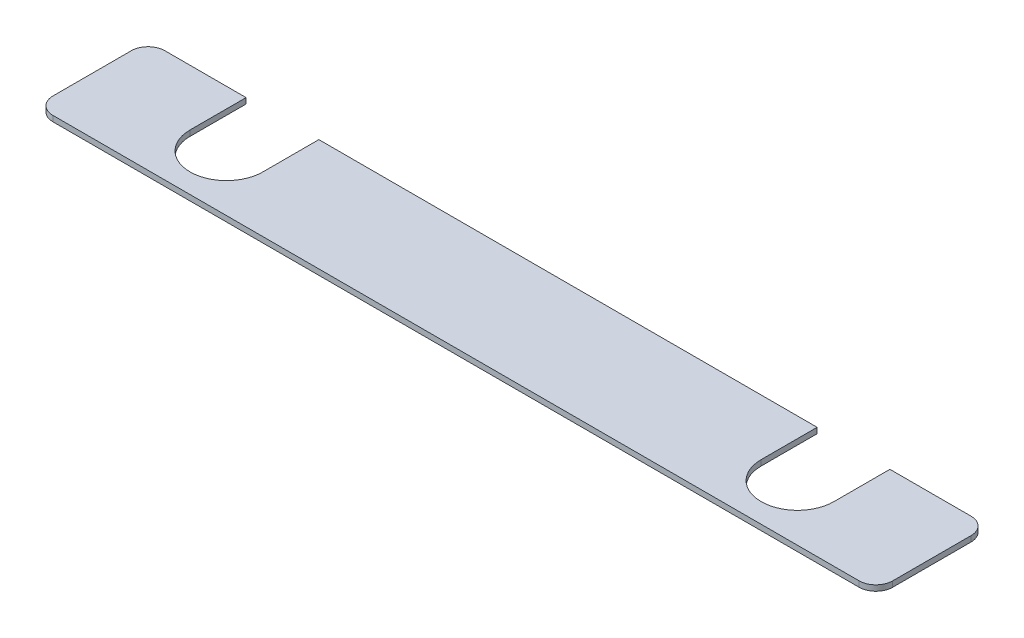
ISO-10303-21;
HEADER;
FILE_DESCRIPTION(('STEP AP214'),'2;1');
FILE_NAME('part.step','',(''),(''),'','','');
FILE_SCHEMA(('AUTOMOTIVE_DESIGN { 1 0 10303 214 1 1 1 1 }'));
ENDSEC;
DATA;
#1=APPLICATION_CONTEXT('core data for automotive mechanical design processes');
#2=APPLICATION_PROTOCOL_DEFINITION('international standard','automotive_design',2000,#1);
#3=PRODUCT_CONTEXT('',#1,'mechanical');
#4=PRODUCT('Part','Part','',(#3));
#5=PRODUCT_RELATED_PRODUCT_CATEGORY('part','',(#4));
#6=PRODUCT_DEFINITION_FORMATION('','',#4);
#7=PRODUCT_DEFINITION_CONTEXT('part definition',#1,'design');
#8=PRODUCT_DEFINITION('design','',#6,#7);
#9=PRODUCT_DEFINITION_SHAPE('','',#8);
#10=(LENGTH_UNIT() NAMED_UNIT(*) SI_UNIT(.MILLI.,.METRE.));
#11=(NAMED_UNIT(*) PLANE_ANGLE_UNIT() SI_UNIT($,.RADIAN.));
#12=(NAMED_UNIT(*) SI_UNIT($,.STERADIAN.) SOLID_ANGLE_UNIT());
#13=UNCERTAINTY_MEASURE_WITH_UNIT(LENGTH_MEASURE(1.E-05),#10,'distance_accuracy_value','');
#14=(GEOMETRIC_REPRESENTATION_CONTEXT(3) GLOBAL_UNCERTAINTY_ASSIGNED_CONTEXT((#13)) GLOBAL_UNIT_ASSIGNED_CONTEXT((#10,
#11,#12)) REPRESENTATION_CONTEXT('',''));
#15=CARTESIAN_POINT('',(0.,0.,0.));
#16=DIRECTION('',(0.,0.,1.));
#17=DIRECTION('',(1.,0.,0.));
#18=AXIS2_PLACEMENT_3D('',#15,#16,#17);
#19=CARTESIAN_POINT('',(-75.,-1.,-10.));
#20=DIRECTION('',(0.,0.,-1.));
#21=DIRECTION('',(-1.,0.,0.));
#22=AXIS2_PLACEMENT_3D('',#19,#20,#21);
#23=PLANE('',#22);
#24=DIRECTION('',(-1.,0.,0.));
#25=VECTOR('',#24,1.);
#26=CARTESIAN_POINT('',(-75.,0.,-10.));
#27=LINE('',#26,#25);
#28=CARTESIAN_POINT('',(72.,0.,-10.));
#29=VERTEX_POINT('',#28);
#30=CARTESIAN_POINT('',(57.5,0.,-10.));
#31=VERTEX_POINT('',#30);
#32=EDGE_CURVE('E226',#29,#31,#27,.T.);
#33=ORIENTED_EDGE('',*,*,#32,.F.);
#34=DIRECTION('',(0.,1.,0.));
#35=VECTOR('',#34,1.);
#36=CARTESIAN_POINT('',(72.,-1.,-10.));
#37=LINE('',#36,#35);
#38=CARTESIAN_POINT('',(72.,-1.,-10.));
#39=VERTEX_POINT('',#38);
#40=EDGE_CURVE('E263',#29,#39,#37,.F.);
#41=ORIENTED_EDGE('',*,*,#40,.T.);
#42=DIRECTION('',(-1.,0.,0.));
#43=VECTOR('',#42,1.);
#44=CARTESIAN_POINT('',(-75.,-1.,-10.));
#45=LINE('',#44,#43);
#46=CARTESIAN_POINT('',(57.5,-1.,-10.));
#47=VERTEX_POINT('',#46);
#48=EDGE_CURVE('E215',#39,#47,#45,.T.);
#49=ORIENTED_EDGE('',*,*,#48,.T.);
#50=DIRECTION('',(0.,1.,0.));
#51=VECTOR('',#50,1.);
#52=CARTESIAN_POINT('',(57.5,-1.,-10.));
#53=LINE('',#52,#51);
#54=EDGE_CURVE('E182',#47,#31,#53,.T.);
#55=ORIENTED_EDGE('',*,*,#54,.T.);
#56=EDGE_LOOP('',(#33,#41,#49,#55));
#57=FACE_BOUND('',#56,.T.);
#58=ADVANCED_FACE('F34',(#57),#23,.T.);
#59=CARTESIAN_POINT('',(44.5,0.,-10.));
#60=VERTEX_POINT('',#59);
#61=CARTESIAN_POINT('',(-44.5,0.,-10.));
#62=VERTEX_POINT('',#61);
#63=EDGE_CURVE('E229',#60,#62,#27,.T.);
#64=ORIENTED_EDGE('',*,*,#63,.F.);
#65=DIRECTION('',(0.,-1.,0.));
#66=VECTOR('',#65,1.);
#67=CARTESIAN_POINT('',(44.5,-1.,-10.));
#68=LINE('',#67,#66);
#69=CARTESIAN_POINT('',(44.5,-1.,-10.));
#70=VERTEX_POINT('',#69);
#71=EDGE_CURVE('E179',#60,#70,#68,.T.);
#72=ORIENTED_EDGE('',*,*,#71,.T.);
#73=CARTESIAN_POINT('',(-44.5,-1.,-10.));
#74=VERTEX_POINT('',#73);
#75=EDGE_CURVE('E172',#70,#74,#45,.T.);
#76=ORIENTED_EDGE('',*,*,#75,.T.);
#77=DIRECTION('',(0.,-1.,0.));
#78=VECTOR('',#77,1.);
#79=CARTESIAN_POINT('',(-44.5,-1.,-10.));
#80=LINE('',#79,#78);
#81=EDGE_CURVE('E206',#62,#74,#80,.T.);
#82=ORIENTED_EDGE('',*,*,#81,.F.);
#83=EDGE_LOOP('',(#64,#72,#76,#82));
#84=FACE_BOUND('',#83,.T.);
#85=ADVANCED_FACE('F286',(#84),#23,.T.);
#86=CARTESIAN_POINT('',(0.,-1.,0.));
#87=DIRECTION('',(0.,-1.,0.));
#88=DIRECTION('',(0.,0.,-1.));
#89=AXIS2_PLACEMENT_3D('',#86,#87,#88);
#90=PLANE('',#89);
#91=DIRECTION('',(0.,0.,-1.));
#92=VECTOR('',#91,1.);
#93=CARTESIAN_POINT('',(75.,-1.,10.));
#94=LINE('',#93,#92);
#95=CARTESIAN_POINT('',(75.,-1.,7.));
#96=VERTEX_POINT('',#95);
#97=CARTESIAN_POINT('',(75.,-1.,-7.));
#98=VERTEX_POINT('',#97);
#99=EDGE_CURVE('E210',#96,#98,#94,.T.);
#100=ORIENTED_EDGE('',*,*,#99,.F.);
#101=CARTESIAN_POINT('',(72.,-1.,7.));
#102=DIRECTION('',(0.,-1.,0.));
#103=DIRECTION('',(0.,0.,-1.));
#104=AXIS2_PLACEMENT_3D('',#101,#102,#103);
#105=CIRCLE('',#104,3.);
#106=CARTESIAN_POINT('',(72.,-1.,10.));
#107=VERTEX_POINT('',#106);
#108=EDGE_CURVE('E261',#96,#107,#105,.T.);
#109=ORIENTED_EDGE('',*,*,#108,.T.);
#110=DIRECTION('',(1.,0.,0.));
#111=VECTOR('',#110,1.);
#112=CARTESIAN_POINT('',(-75.,-1.,10.));
#113=LINE('',#112,#111);
#114=CARTESIAN_POINT('',(-72.,-1.,10.));
#115=VERTEX_POINT('',#114);
#116=EDGE_CURVE('E219',#115,#107,#113,.T.);
#117=ORIENTED_EDGE('',*,*,#116,.F.);
#118=CARTESIAN_POINT('',(-72.,-1.,7.));
#119=DIRECTION('',(0.,-1.,0.));
#120=DIRECTION('',(0.,0.,-1.));
#121=AXIS2_PLACEMENT_3D('',#118,#119,#120);
#122=CIRCLE('',#121,3.);
#123=CARTESIAN_POINT('',(-75.,-1.,7.));
#124=VERTEX_POINT('',#123);
#125=EDGE_CURVE('E55',#115,#124,#122,.T.);
#126=ORIENTED_EDGE('',*,*,#125,.T.);
#127=DIRECTION('',(0.,0.,1.));
#128=VECTOR('',#127,1.);
#129=CARTESIAN_POINT('',(-75.,-1.,10.));
#130=LINE('',#129,#128);
#131=CARTESIAN_POINT('',(-75.,-1.,-7.));
#132=VERTEX_POINT('',#131);
#133=EDGE_CURVE('E217',#132,#124,#130,.T.);
#134=ORIENTED_EDGE('',*,*,#133,.F.);
#135=CARTESIAN_POINT('',(-72.,-1.,-7.));
#136=DIRECTION('',(0.,-1.,0.));
#137=DIRECTION('',(0.,0.,-1.));
#138=AXIS2_PLACEMENT_3D('',#135,#136,#137);
#139=CIRCLE('',#138,3.);
#140=CARTESIAN_POINT('',(-72.,-1.,-10.));
#141=VERTEX_POINT('',#140);
#142=EDGE_CURVE('E49',#132,#141,#139,.T.);
#143=ORIENTED_EDGE('',*,*,#142,.T.);
#144=CARTESIAN_POINT('',(-57.5,-1.,-10.));
#145=VERTEX_POINT('',#144);
#146=EDGE_CURVE('E213',#145,#141,#45,.T.);
#147=ORIENTED_EDGE('',*,*,#146,.F.);
#148=DIRECTION('',(0.,0.,1.));
#149=VECTOR('',#148,1.);
#150=CARTESIAN_POINT('',(-57.5,-1.,-20.));
#151=LINE('',#150,#149);
#152=CARTESIAN_POINT('',(-57.5,-1.,0.));
#153=VERTEX_POINT('',#152);
#154=EDGE_CURVE('E186',#145,#153,#151,.T.);
#155=ORIENTED_EDGE('',*,*,#154,.T.);
#156=CARTESIAN_POINT('',(-51.,-1.,0.));
#157=DIRECTION('',(0.,1.,0.));
#158=DIRECTION('',(0.,0.,1.));
#159=AXIS2_PLACEMENT_3D('',#156,#157,#158);
#160=CIRCLE('',#159,6.5);
#161=CARTESIAN_POINT('',(-44.5,-1.,0.));
#162=VERTEX_POINT('',#161);
#163=EDGE_CURVE('E189',#153,#162,#160,.T.);
#164=ORIENTED_EDGE('',*,*,#163,.T.);
#165=DIRECTION('',(0.,0.,-1.));
#166=VECTOR('',#165,1.);
#167=CARTESIAN_POINT('',(-44.5,-1.,-20.));
#168=LINE('',#167,#166);
#169=EDGE_CURVE('E193',#162,#74,#168,.T.);
#170=ORIENTED_EDGE('',*,*,#169,.T.);
#171=ORIENTED_EDGE('',*,*,#75,.F.);
#172=DIRECTION('',(0.,0.,-1.));
#173=VECTOR('',#172,1.);
#174=CARTESIAN_POINT('',(44.5,-1.,-20.));
#175=LINE('',#174,#173);
#176=CARTESIAN_POINT('',(44.5,-1.,0.));
#177=VERTEX_POINT('',#176);
#178=EDGE_CURVE('E159',#177,#70,#175,.T.);
#179=ORIENTED_EDGE('',*,*,#178,.F.);
#180=CARTESIAN_POINT('',(51.,-1.,0.));
#181=DIRECTION('',(0.,-1.,0.));
#182=DIRECTION('',(0.,0.,1.));
#183=AXIS2_PLACEMENT_3D('',#180,#181,#182);
#184=CIRCLE('',#183,6.5);
#185=CARTESIAN_POINT('',(57.5,-1.,0.));
#186=VERTEX_POINT('',#185);
#187=EDGE_CURVE('E149',#186,#177,#184,.T.);
#188=ORIENTED_EDGE('',*,*,#187,.F.);
#189=DIRECTION('',(0.,0.,1.));
#190=VECTOR('',#189,1.);
#191=CARTESIAN_POINT('',(57.5,-1.,-20.));
#192=LINE('',#191,#190);
#193=EDGE_CURVE('E158',#47,#186,#192,.T.);
#194=ORIENTED_EDGE('',*,*,#193,.F.);
#195=ORIENTED_EDGE('',*,*,#48,.F.);
#196=CARTESIAN_POINT('',(72.,-1.,-7.));
#197=DIRECTION('',(0.,-1.,0.));
#198=DIRECTION('',(0.,0.,-1.));
#199=AXIS2_PLACEMENT_3D('',#196,#197,#198);
#200=CIRCLE('',#199,3.);
#201=EDGE_CURVE('E259',#39,#98,#200,.T.);
#202=ORIENTED_EDGE('',*,*,#201,.T.);
#203=EDGE_LOOP('',(#100,#109,#117,#126,#134,#143,#147,#155,#164,#170,#171,#179,#188,#194,#195,#202));
#204=FACE_BOUND('',#203,.T.);
#205=ADVANCED_FACE('F170',(#204),#90,.T.);
#206=CARTESIAN_POINT('',(0.,0.,0.));
#207=DIRECTION('',(0.,-1.,0.));
#208=DIRECTION('',(0.,0.,-1.));
#209=AXIS2_PLACEMENT_3D('',#206,#207,#208);
#210=PLANE('',#209);
#211=DIRECTION('',(1.,0.,0.));
#212=VECTOR('',#211,1.);
#213=CARTESIAN_POINT('',(-75.,0.,10.));
#214=LINE('',#213,#212);
#215=CARTESIAN_POINT('',(-72.,0.,10.));
#216=VERTEX_POINT('',#215);
#217=CARTESIAN_POINT('',(72.,0.,10.));
#218=VERTEX_POINT('',#217);
#219=EDGE_CURVE('E214',#216,#218,#214,.T.);
#220=ORIENTED_EDGE('',*,*,#219,.T.);
#221=CARTESIAN_POINT('',(72.,0.,7.));
#222=DIRECTION('',(0.,-1.,0.));
#223=DIRECTION('',(0.,0.,-1.));
#224=AXIS2_PLACEMENT_3D('',#221,#222,#223);
#225=CIRCLE('',#224,3.);
#226=CARTESIAN_POINT('',(75.,0.,7.));
#227=VERTEX_POINT('',#226);
#228=EDGE_CURVE('E250',#218,#227,#225,.F.);
#229=ORIENTED_EDGE('',*,*,#228,.T.);
#230=DIRECTION('',(0.,0.,-1.));
#231=VECTOR('',#230,1.);
#232=CARTESIAN_POINT('',(75.,0.,10.));
#233=LINE('',#232,#231);
#234=CARTESIAN_POINT('',(75.,0.,-7.));
#235=VERTEX_POINT('',#234);
#236=EDGE_CURVE('E209',#227,#235,#233,.T.);
#237=ORIENTED_EDGE('',*,*,#236,.T.);
#238=CARTESIAN_POINT('',(72.,0.,-7.));
#239=DIRECTION('',(0.,-1.,0.));
#240=DIRECTION('',(0.,0.,-1.));
#241=AXIS2_PLACEMENT_3D('',#238,#239,#240);
#242=CIRCLE('',#241,3.);
#243=EDGE_CURVE('E248',#235,#29,#242,.F.);
#244=ORIENTED_EDGE('',*,*,#243,.T.);
#245=ORIENTED_EDGE('',*,*,#32,.T.);
#246=DIRECTION('',(0.,0.,-1.));
#247=VECTOR('',#246,1.);
#248=CARTESIAN_POINT('',(57.5,0.,0.));
#249=LINE('',#248,#247);
#250=CARTESIAN_POINT('',(57.5,0.,0.));
#251=VERTEX_POINT('',#250);
#252=EDGE_CURVE('E236',#251,#31,#249,.T.);
#253=ORIENTED_EDGE('',*,*,#252,.F.);
#254=CARTESIAN_POINT('',(51.,0.,0.));
#255=DIRECTION('',(0.,-1.,0.));
#256=DIRECTION('',(0.,0.,1.));
#257=AXIS2_PLACEMENT_3D('',#254,#255,#256);
#258=CIRCLE('',#257,6.5);
#259=CARTESIAN_POINT('',(44.5,0.,0.));
#260=VERTEX_POINT('',#259);
#261=EDGE_CURVE('E173',#251,#260,#258,.T.);
#262=ORIENTED_EDGE('',*,*,#261,.T.);
#263=DIRECTION('',(0.,0.,-1.));
#264=VECTOR('',#263,1.);
#265=CARTESIAN_POINT('',(44.5,0.,-20.));
#266=LINE('',#265,#264);
#267=EDGE_CURVE('E165',#260,#60,#266,.T.);
#268=ORIENTED_EDGE('',*,*,#267,.T.);
#269=ORIENTED_EDGE('',*,*,#63,.T.);
#270=DIRECTION('',(0.,0.,-1.));
#271=VECTOR('',#270,1.);
#272=CARTESIAN_POINT('',(-44.5,0.,-20.));
#273=LINE('',#272,#271);
#274=CARTESIAN_POINT('',(-44.5,0.,0.));
#275=VERTEX_POINT('',#274);
#276=EDGE_CURVE('E190',#275,#62,#273,.T.);
#277=ORIENTED_EDGE('',*,*,#276,.F.);
#278=CARTESIAN_POINT('',(-51.,0.,0.));
#279=DIRECTION('',(0.,1.,0.));
#280=DIRECTION('',(0.,0.,1.));
#281=AXIS2_PLACEMENT_3D('',#278,#279,#280);
#282=CIRCLE('',#281,6.5);
#283=CARTESIAN_POINT('',(-57.5,0.,0.));
#284=VERTEX_POINT('',#283);
#285=EDGE_CURVE('E185',#284,#275,#282,.T.);
#286=ORIENTED_EDGE('',*,*,#285,.F.);
#287=DIRECTION('',(0.,0.,-1.));
#288=VECTOR('',#287,1.);
#289=CARTESIAN_POINT('',(-57.5,0.,0.));
#290=LINE('',#289,#288);
#291=CARTESIAN_POINT('',(-57.5,0.,-10.));
#292=VERTEX_POINT('',#291);
#293=EDGE_CURVE('E222',#284,#292,#290,.T.);
#294=ORIENTED_EDGE('',*,*,#293,.T.);
#295=CARTESIAN_POINT('',(-72.,0.,-10.));
#296=VERTEX_POINT('',#295);
#297=EDGE_CURVE('E225',#292,#296,#27,.T.);
#298=ORIENTED_EDGE('',*,*,#297,.T.);
#299=CARTESIAN_POINT('',(-72.,0.,-7.));
#300=DIRECTION('',(0.,-1.,0.));
#301=DIRECTION('',(0.,0.,-1.));
#302=AXIS2_PLACEMENT_3D('',#299,#300,#301);
#303=CIRCLE('',#302,3.);
#304=CARTESIAN_POINT('',(-75.,0.,-7.));
#305=VERTEX_POINT('',#304);
#306=EDGE_CURVE('E244',#296,#305,#303,.F.);
#307=ORIENTED_EDGE('',*,*,#306,.T.);
#308=DIRECTION('',(0.,0.,1.));
#309=VECTOR('',#308,1.);
#310=CARTESIAN_POINT('',(-75.,0.,10.));
#311=LINE('',#310,#309);
#312=CARTESIAN_POINT('',(-75.,0.,7.));
#313=VERTEX_POINT('',#312);
#314=EDGE_CURVE('E228',#305,#313,#311,.T.);
#315=ORIENTED_EDGE('',*,*,#314,.T.);
#316=CARTESIAN_POINT('',(-72.,0.,7.));
#317=DIRECTION('',(0.,-1.,0.));
#318=DIRECTION('',(0.,0.,-1.));
#319=AXIS2_PLACEMENT_3D('',#316,#317,#318);
#320=CIRCLE('',#319,3.);
#321=EDGE_CURVE('E246',#313,#216,#320,.F.);
#322=ORIENTED_EDGE('',*,*,#321,.T.);
#323=EDGE_LOOP('',(#220,#229,#237,#244,#245,#253,#262,#268,#269,#277,#286,#294,#298,#307,#315,#322));
#324=FACE_BOUND('',#323,.T.);
#325=ADVANCED_FACE('F274',(#324),#210,.F.);
#326=CARTESIAN_POINT('',(75.,-1.,10.));
#327=DIRECTION('',(1.,0.,0.));
#328=DIRECTION('',(0.,0.,-1.));
#329=AXIS2_PLACEMENT_3D('',#326,#327,#328);
#330=PLANE('',#329);
#331=ORIENTED_EDGE('',*,*,#236,.F.);
#332=DIRECTION('',(0.,1.,0.));
#333=VECTOR('',#332,1.);
#334=CARTESIAN_POINT('',(75.,-1.,7.));
#335=LINE('',#334,#333);
#336=EDGE_CURVE('E255',#227,#96,#335,.F.);
#337=ORIENTED_EDGE('',*,*,#336,.T.);
#338=ORIENTED_EDGE('',*,*,#99,.T.);
#339=DIRECTION('',(0.,1.,0.));
#340=VECTOR('',#339,1.);
#341=CARTESIAN_POINT('',(75.,-1.,-7.));
#342=LINE('',#341,#340);
#343=EDGE_CURVE('E252',#98,#235,#342,.T.);
#344=ORIENTED_EDGE('',*,*,#343,.T.);
#345=EDGE_LOOP('',(#331,#337,#338,#344));
#346=FACE_BOUND('',#345,.T.);
#347=ADVANCED_FACE('F309',(#346),#330,.T.);
#348=CARTESIAN_POINT('',(-75.,-1.,10.));
#349=DIRECTION('',(0.,0.,1.));
#350=DIRECTION('',(1.,0.,0.));
#351=AXIS2_PLACEMENT_3D('',#348,#349,#350);
#352=PLANE('',#351);
#353=ORIENTED_EDGE('',*,*,#116,.T.);
#354=DIRECTION('',(0.,1.,0.));
#355=VECTOR('',#354,1.);
#356=CARTESIAN_POINT('',(72.,-1.,10.));
#357=LINE('',#356,#355);
#358=EDGE_CURVE('E241',#107,#218,#357,.T.);
#359=ORIENTED_EDGE('',*,*,#358,.T.);
#360=ORIENTED_EDGE('',*,*,#219,.F.);
#361=DIRECTION('',(0.,1.,0.));
#362=VECTOR('',#361,1.);
#363=CARTESIAN_POINT('',(-72.,-1.,10.));
#364=LINE('',#363,#362);
#365=EDGE_CURVE('E239',#216,#115,#364,.F.);
#366=ORIENTED_EDGE('',*,*,#365,.T.);
#367=EDGE_LOOP('',(#353,#359,#360,#366));
#368=FACE_BOUND('',#367,.T.);
#369=ADVANCED_FACE('F316',(#368),#352,.T.);
#370=CARTESIAN_POINT('',(-75.,-1.,10.));
#371=DIRECTION('',(-1.,0.,0.));
#372=DIRECTION('',(0.,0.,1.));
#373=AXIS2_PLACEMENT_3D('',#370,#371,#372);
#374=PLANE('',#373);
#375=ORIENTED_EDGE('',*,*,#133,.T.);
#376=DIRECTION('',(0.,1.,0.));
#377=VECTOR('',#376,1.);
#378=CARTESIAN_POINT('',(-75.,-1.,7.));
#379=LINE('',#378,#377);
#380=EDGE_CURVE('E42',#124,#313,#379,.T.);
#381=ORIENTED_EDGE('',*,*,#380,.T.);
#382=ORIENTED_EDGE('',*,*,#314,.F.);
#383=DIRECTION('',(0.,1.,0.));
#384=VECTOR('',#383,1.);
#385=CARTESIAN_POINT('',(-75.,-1.,-7.));
#386=LINE('',#385,#384);
#387=EDGE_CURVE('E265',#305,#132,#386,.F.);
#388=ORIENTED_EDGE('',*,*,#387,.T.);
#389=EDGE_LOOP('',(#375,#381,#382,#388));
#390=FACE_BOUND('',#389,.T.);
#391=ADVANCED_FACE('F270',(#390),#374,.T.);
#392=ORIENTED_EDGE('',*,*,#146,.T.);
#393=DIRECTION('',(0.,1.,0.));
#394=VECTOR('',#393,1.);
#395=CARTESIAN_POINT('',(-72.,-1.,-10.));
#396=LINE('',#395,#394);
#397=EDGE_CURVE('E11',#141,#296,#396,.T.);
#398=ORIENTED_EDGE('',*,*,#397,.T.);
#399=ORIENTED_EDGE('',*,*,#297,.F.);
#400=DIRECTION('',(0.,1.,0.));
#401=VECTOR('',#400,1.);
#402=CARTESIAN_POINT('',(-57.5,-1.,-10.));
#403=LINE('',#402,#401);
#404=EDGE_CURVE('E202',#145,#292,#403,.T.);
#405=ORIENTED_EDGE('',*,*,#404,.F.);
#406=EDGE_LOOP('',(#392,#398,#399,#405));
#407=FACE_BOUND('',#406,.T.);
#408=ADVANCED_FACE('F281',(#407),#23,.T.);
#409=CARTESIAN_POINT('',(-44.5,-1.,-20.));
#410=DIRECTION('',(1.,0.,0.));
#411=DIRECTION('',(0.,0.,-1.));
#412=AXIS2_PLACEMENT_3D('',#409,#410,#411);
#413=PLANE('',#412);
#414=ORIENTED_EDGE('',*,*,#81,.T.);
#415=ORIENTED_EDGE('',*,*,#169,.F.);
#416=DIRECTION('',(0.,1.,0.));
#417=VECTOR('',#416,1.);
#418=CARTESIAN_POINT('',(-44.5,-1.,0.));
#419=LINE('',#418,#417);
#420=EDGE_CURVE('E200',#162,#275,#419,.T.);
#421=ORIENTED_EDGE('',*,*,#420,.T.);
#422=ORIENTED_EDGE('',*,*,#276,.T.);
#423=EDGE_LOOP('',(#414,#415,#421,#422));
#424=FACE_BOUND('',#423,.T.);
#425=ADVANCED_FACE('F289',(#424),#413,.F.);
#426=CARTESIAN_POINT('',(-51.,-1.,0.));
#427=DIRECTION('',(0.,1.,0.));
#428=DIRECTION('',(0.,0.,1.));
#429=AXIS2_PLACEMENT_3D('',#426,#427,#428);
#430=CYLINDRICAL_SURFACE('',#429,6.5);
#431=ORIENTED_EDGE('',*,*,#285,.T.);
#432=ORIENTED_EDGE('',*,*,#420,.F.);
#433=ORIENTED_EDGE('',*,*,#163,.F.);
#434=DIRECTION('',(0.,1.,0.));
#435=VECTOR('',#434,1.);
#436=CARTESIAN_POINT('',(-57.5,-1.,0.));
#437=LINE('',#436,#435);
#438=EDGE_CURVE('E195',#153,#284,#437,.T.);
#439=ORIENTED_EDGE('',*,*,#438,.T.);
#440=EDGE_LOOP('',(#431,#432,#433,#439));
#441=FACE_BOUND('',#440,.T.);
#442=ADVANCED_FACE('F293',(#441),#430,.F.);
#443=CARTESIAN_POINT('',(-57.5,-1.,-20.));
#444=DIRECTION('',(-1.,0.,0.));
#445=DIRECTION('',(0.,0.,1.));
#446=AXIS2_PLACEMENT_3D('',#443,#444,#445);
#447=PLANE('',#446);
#448=ORIENTED_EDGE('',*,*,#404,.T.);
#449=ORIENTED_EDGE('',*,*,#293,.F.);
#450=ORIENTED_EDGE('',*,*,#438,.F.);
#451=ORIENTED_EDGE('',*,*,#154,.F.);
#452=EDGE_LOOP('',(#448,#449,#450,#451));
#453=FACE_BOUND('',#452,.T.);
#454=ADVANCED_FACE('F347',(#453),#447,.F.);
#455=CARTESIAN_POINT('',(57.5,-1.,-20.));
#456=DIRECTION('',(-1.,0.,0.));
#457=DIRECTION('',(0.,0.,1.));
#458=AXIS2_PLACEMENT_3D('',#455,#456,#457);
#459=PLANE('',#458);
#460=ORIENTED_EDGE('',*,*,#193,.T.);
#461=DIRECTION('',(0.,1.,0.));
#462=VECTOR('',#461,1.);
#463=CARTESIAN_POINT('',(57.5,-1.,0.));
#464=LINE('',#463,#462);
#465=EDGE_CURVE('E155',#186,#251,#464,.T.);
#466=ORIENTED_EDGE('',*,*,#465,.T.);
#467=ORIENTED_EDGE('',*,*,#252,.T.);
#468=ORIENTED_EDGE('',*,*,#54,.F.);
#469=EDGE_LOOP('',(#460,#466,#467,#468));
#470=FACE_BOUND('',#469,.T.);
#471=ADVANCED_FACE('F299',(#470),#459,.T.);
#472=CARTESIAN_POINT('',(51.,-1.,0.));
#473=DIRECTION('',(0.,1.,0.));
#474=DIRECTION('',(0.,0.,1.));
#475=AXIS2_PLACEMENT_3D('',#472,#473,#474);
#476=CYLINDRICAL_SURFACE('',#475,6.5);
#477=ORIENTED_EDGE('',*,*,#261,.F.);
#478=ORIENTED_EDGE('',*,*,#465,.F.);
#479=ORIENTED_EDGE('',*,*,#187,.T.);
#480=DIRECTION('',(0.,1.,0.));
#481=VECTOR('',#480,1.);
#482=CARTESIAN_POINT('',(44.5,-1.,0.));
#483=LINE('',#482,#481);
#484=EDGE_CURVE('E153',#177,#260,#483,.T.);
#485=ORIENTED_EDGE('',*,*,#484,.T.);
#486=EDGE_LOOP('',(#477,#478,#479,#485));
#487=FACE_BOUND('',#486,.T.);
#488=ADVANCED_FACE('F152',(#487),#476,.F.);
#489=CARTESIAN_POINT('',(44.5,-1.,-20.));
#490=DIRECTION('',(1.,0.,0.));
#491=DIRECTION('',(0.,0.,-1.));
#492=AXIS2_PLACEMENT_3D('',#489,#490,#491);
#493=PLANE('',#492);
#494=ORIENTED_EDGE('',*,*,#267,.F.);
#495=ORIENTED_EDGE('',*,*,#484,.F.);
#496=ORIENTED_EDGE('',*,*,#178,.T.);
#497=ORIENTED_EDGE('',*,*,#71,.F.);
#498=EDGE_LOOP('',(#494,#495,#496,#497));
#499=FACE_BOUND('',#498,.T.);
#500=ADVANCED_FACE('F162',(#499),#493,.T.);
#501=CARTESIAN_POINT('',(72.,-1.,7.));
#502=DIRECTION('',(0.,1.,0.));
#503=DIRECTION('',(0.,0.,1.));
#504=AXIS2_PLACEMENT_3D('',#501,#502,#503);
#505=CYLINDRICAL_SURFACE('',#504,3.);
#506=ORIENTED_EDGE('',*,*,#108,.F.);
#507=ORIENTED_EDGE('',*,*,#336,.F.);
#508=ORIENTED_EDGE('',*,*,#228,.F.);
#509=ORIENTED_EDGE('',*,*,#358,.F.);
#510=EDGE_LOOP('',(#506,#507,#508,#509));
#511=FACE_BOUND('',#510,.T.);
#512=ADVANCED_FACE('F314',(#511),#505,.T.);
#513=CARTESIAN_POINT('',(72.,-1.,-7.));
#514=DIRECTION('',(0.,1.,0.));
#515=DIRECTION('',(0.,0.,1.));
#516=AXIS2_PLACEMENT_3D('',#513,#514,#515);
#517=CYLINDRICAL_SURFACE('',#516,3.);
#518=ORIENTED_EDGE('',*,*,#201,.F.);
#519=ORIENTED_EDGE('',*,*,#40,.F.);
#520=ORIENTED_EDGE('',*,*,#243,.F.);
#521=ORIENTED_EDGE('',*,*,#343,.F.);
#522=EDGE_LOOP('',(#518,#519,#520,#521));
#523=FACE_BOUND('',#522,.T.);
#524=ADVANCED_FACE('F306',(#523),#517,.T.);
#525=CARTESIAN_POINT('',(-72.,-1.,7.));
#526=DIRECTION('',(0.,1.,0.));
#527=DIRECTION('',(0.,0.,1.));
#528=AXIS2_PLACEMENT_3D('',#525,#526,#527);
#529=CYLINDRICAL_SURFACE('',#528,3.);
#530=ORIENTED_EDGE('',*,*,#125,.F.);
#531=ORIENTED_EDGE('',*,*,#365,.F.);
#532=ORIENTED_EDGE('',*,*,#321,.F.);
#533=ORIENTED_EDGE('',*,*,#380,.F.);
#534=EDGE_LOOP('',(#530,#531,#532,#533));
#535=FACE_BOUND('',#534,.T.);
#536=ADVANCED_FACE('F318',(#535),#529,.T.);
#537=CARTESIAN_POINT('',(-72.,-1.,-7.));
#538=DIRECTION('',(0.,1.,0.));
#539=DIRECTION('',(0.,0.,1.));
#540=AXIS2_PLACEMENT_3D('',#537,#538,#539);
#541=CYLINDRICAL_SURFACE('',#540,3.);
#542=ORIENTED_EDGE('',*,*,#142,.F.);
#543=ORIENTED_EDGE('',*,*,#387,.F.);
#544=ORIENTED_EDGE('',*,*,#306,.F.);
#545=ORIENTED_EDGE('',*,*,#397,.F.);
#546=EDGE_LOOP('',(#542,#543,#544,#545));
#547=FACE_BOUND('',#546,.T.);
#548=ADVANCED_FACE('F36',(#547),#541,.T.);
#549=CLOSED_SHELL('',(#58,#85,#205,#325,#347,#369,#391,#408,#425,#442,#454,#471,#488,#500,#512,
#524,#536,#548));
#550=MANIFOLD_SOLID_BREP('B2',#549);
#551=ADVANCED_BREP_SHAPE_REPRESENTATION('',(#18,#550),#14);
#552=SHAPE_DEFINITION_REPRESENTATION(#9,#551);
ENDSEC;
END-ISO-10303-21;
